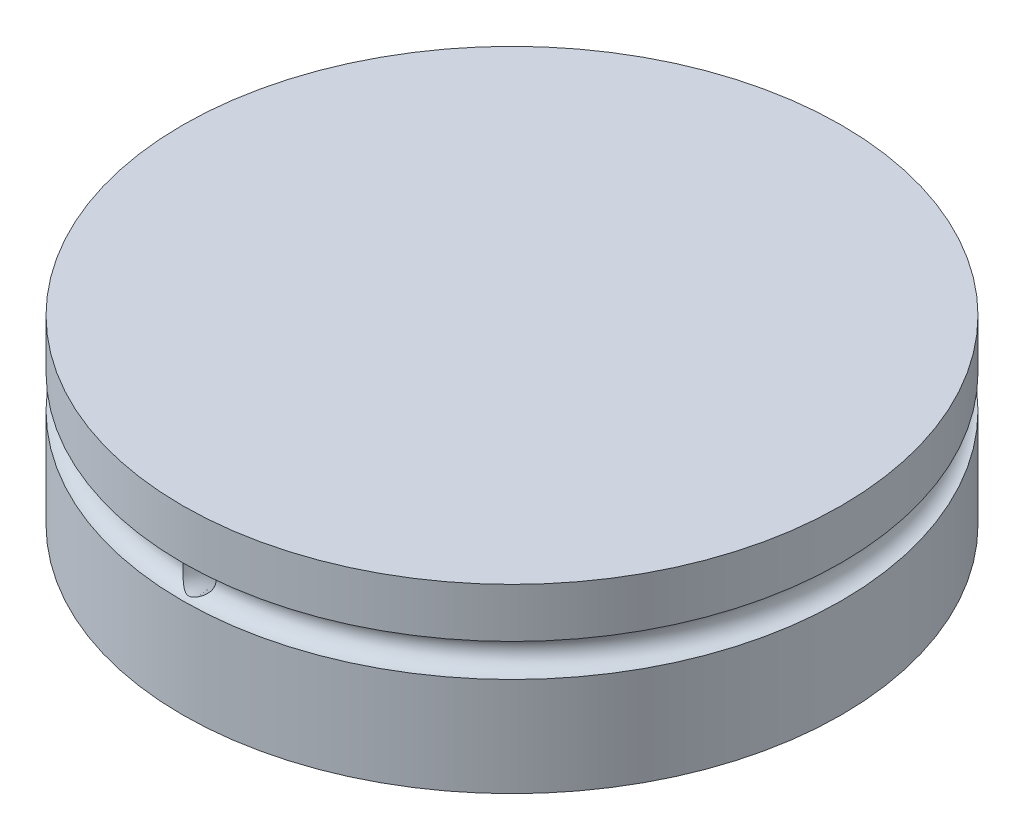
ISO-10303-21;
HEADER;
FILE_DESCRIPTION(('STEP AP214'),'2;1');
FILE_NAME('part.step','',(''),(''),'','','');
FILE_SCHEMA(('AUTOMOTIVE_DESIGN { 1 0 10303 214 1 1 1 1 }'));
ENDSEC;
DATA;
#1=APPLICATION_CONTEXT('core data for automotive mechanical design processes');
#2=APPLICATION_PROTOCOL_DEFINITION('international standard','automotive_design',2000,#1);
#3=PRODUCT_CONTEXT('',#1,'mechanical');
#4=PRODUCT('Part','Part','',(#3));
#5=PRODUCT_RELATED_PRODUCT_CATEGORY('part','',(#4));
#6=PRODUCT_DEFINITION_FORMATION('','',#4);
#7=PRODUCT_DEFINITION_CONTEXT('part definition',#1,'design');
#8=PRODUCT_DEFINITION('design','',#6,#7);
#9=PRODUCT_DEFINITION_SHAPE('','',#8);
#10=(LENGTH_UNIT() NAMED_UNIT(*) SI_UNIT(.MILLI.,.METRE.));
#11=(NAMED_UNIT(*) PLANE_ANGLE_UNIT() SI_UNIT($,.RADIAN.));
#12=(NAMED_UNIT(*) SI_UNIT($,.STERADIAN.) SOLID_ANGLE_UNIT());
#13=UNCERTAINTY_MEASURE_WITH_UNIT(LENGTH_MEASURE(1.E-05),#10,'distance_accuracy_value','');
#14=(GEOMETRIC_REPRESENTATION_CONTEXT(3) GLOBAL_UNCERTAINTY_ASSIGNED_CONTEXT((#13)) GLOBAL_UNIT_ASSIGNED_CONTEXT((#10,
#11,#12)) REPRESENTATION_CONTEXT('',''));
#15=CARTESIAN_POINT('',(0.,0.,0.));
#16=DIRECTION('',(0.,0.,1.));
#17=DIRECTION('',(1.,0.,0.));
#18=AXIS2_PLACEMENT_3D('',#15,#16,#17);
#19=CARTESIAN_POINT('',(0.,0.,0.));
#20=DIRECTION('',(0.,1.,0.));
#21=DIRECTION('',(0.,0.,1.));
#22=AXIS2_PLACEMENT_3D('',#19,#20,#21);
#23=PLANE('',#22);
#24=CARTESIAN_POINT('',(0.,0.,0.));
#25=DIRECTION('',(0.,1.,0.));
#26=DIRECTION('',(0.,0.,1.));
#27=AXIS2_PLACEMENT_3D('',#24,#25,#26);
#28=CIRCLE('',#27,20.);
#29=CARTESIAN_POINT('',(0.,0.,20.));
#30=VERTEX_POINT('',#29);
#31=EDGE_CURVE('E154',#30,#30,#28,.T.);
#32=ORIENTED_EDGE('',*,*,#31,.F.);
#33=EDGE_LOOP('',(#32));
#34=FACE_BOUND('',#33,.T.);
#35=CARTESIAN_POINT('',(0.,0.,0.));
#36=DIRECTION('',(0.,1.,0.));
#37=DIRECTION('',(1.,0.,0.));
#38=AXIS2_PLACEMENT_3D('',#35,#36,#37);
#39=ELLIPSE('',#38,19.,6.);
#40=CARTESIAN_POINT('',(19.,0.,0.));
#41=VERTEX_POINT('',#40);
#42=EDGE_CURVE('E136',#41,#41,#39,.T.);
#43=ORIENTED_EDGE('',*,*,#42,.T.);
#44=EDGE_LOOP('',(#43));
#45=FACE_BOUND('',#44,.T.);
#46=CARTESIAN_POINT('',(0.,2.87470150810809E-09,11.9189853511078));
#47=CARTESIAN_POINT('',(-0.0561777969338795,3.53265097395155E-09,11.9189891886402));
#48=CARTESIAN_POINT('',(-0.112414155046162,6.48629694471309E-10,11.9237415156804));
#49=CARTESIAN_POINT('',(-0.195516780584959,-3.24851267192243E-10,11.9378797379032));
#50=CARTESIAN_POINT('',(-0.223031183899827,-8.90044293983763E-11,11.943768526186));
#51=CARTESIAN_POINT('',(-0.277493185797707,8.90830293124296E-11,11.9578459703527));
#52=CARTESIAN_POINT('',(-0.304440262377215,3.10641823119621E-11,11.9660366526601));
#53=CARTESIAN_POINT('',(-0.384033110352354,-6.20077604010487E-11,11.9939601855703));
#54=CARTESIAN_POINT('',(-0.435539560435894,-1.66150531424652E-11,12.0170631864975));
#55=CARTESIAN_POINT('',(-0.533916964943558,1.66153755751169E-11,12.0715779168258));
#56=CARTESIAN_POINT('',(-0.580787829391597,4.45198010174337E-12,12.1029898074578));
#57=CARTESIAN_POINT('',(-0.668596507700987,-4.45193758655769E-12,12.1732386694411));
#58=CARTESIAN_POINT('',(-0.709534495554499,-1.19291218578032E-12,12.2120754229675));
#59=CARTESIAN_POINT('',(-0.784308982924737,1.19295902058882E-12,12.2960713578728));
#60=CARTESIAN_POINT('',(-0.818145203567523,3.19642588058658E-13,12.341230787416));
#61=CARTESIAN_POINT('',(-0.877755557618486,-3.19636634941162E-13,12.4365886952946));
#62=CARTESIAN_POINT('',(-0.903529841165609,0.,12.4867870797654));
#63=CARTESIAN_POINT('',(-0.946284800978254,0.,12.5907983321467));
#64=CARTESIAN_POINT('',(-0.963265494925926,0.,12.6446111927888));
#65=CARTESIAN_POINT('',(-0.987951527529939,0.,12.7543240538217));
#66=CARTESIAN_POINT('',(-0.995656848504105,0.,12.8102240581911));
#67=CARTESIAN_POINT('',(-1.00157329044895,0.,12.9225241556603));
#68=CARTESIAN_POINT('',(-0.999784428527204,0.,12.9789242478589));
#69=CARTESIAN_POINT('',(-0.98676333543744,0.,13.0906236153357));
#70=CARTESIAN_POINT('',(-0.975531100745607,0.,13.1459228902033));
#71=CARTESIAN_POINT('',(-0.943942086909743,0.,13.253850875258));
#72=CARTESIAN_POINT('',(-0.923585298133772,0.,13.306479582626));
#73=CARTESIAN_POINT('',(-0.874325052556035,0.,13.40757237774));
#74=CARTESIAN_POINT('',(-0.845421598535563,0.,13.4560364668413));
#75=CARTESIAN_POINT('',(-0.77988851749711,0.,13.5474242725355));
#76=CARTESIAN_POINT('',(-0.743258893606428,0.,13.5903479913709));
#77=CARTESIAN_POINT('',(-0.66331326724979,0.,13.6694366073531));
#78=CARTESIAN_POINT('',(-0.619997263867522,0.,13.7056015035736));
#79=CARTESIAN_POINT('',(-0.527908489953462,0.,13.7701458562925));
#80=CARTESIAN_POINT('',(-0.479135718708562,0.,13.7985253117735));
#81=CARTESIAN_POINT('',(-0.377517931624595,0.,13.8466931663077));
#82=CARTESIAN_POINT('',(-0.324672915959887,0.,13.8664815657287));
#83=CARTESIAN_POINT('',(-0.216410755334807,0.,13.8969055747304));
#84=CARTESIAN_POINT('',(-0.160993610490312,0.,13.9075411847233));
#85=CARTESIAN_POINT('',(-0.0491603190299546,0.,13.9193577026984));
#86=CARTESIAN_POINT('',(0.00725582758590798,0.,13.9205386106805));
#87=CARTESIAN_POINT('',(0.119485636664509,0.,13.913412201967));
#88=CARTESIAN_POINT('',(0.175299299100105,0.,13.905104884844));
#89=CARTESIAN_POINT('',(0.28473975373675,0.,13.8792378449822));
#90=CARTESIAN_POINT('',(0.338366545844167,0.,13.8616781218474));
#91=CARTESIAN_POINT('',(0.441910943338351,0.,13.8178047415757));
#92=CARTESIAN_POINT('',(0.491828549209845,0.,13.7914910855828));
#93=CARTESIAN_POINT('',(0.586537561610919,0.,13.7308568104446));
#94=CARTESIAN_POINT('',(0.631328968843,0.,13.6965361923964));
#95=CARTESIAN_POINT('',(0.714514112869744,0.,13.6208622368157));
#96=CARTESIAN_POINT('',(0.752907847074838,0.,13.5795088964365));
#97=CARTESIAN_POINT('',(0.822207748826863,0.,13.4909433916648));
#98=CARTESIAN_POINT('',(0.853113913937177,0.,13.4437312253657));
#99=CARTESIAN_POINT('',(0.906561296057692,0.,13.3447883474134));
#100=CARTESIAN_POINT('',(0.929102521897967,0.,13.2930576405301));
#101=CARTESIAN_POINT('',(0.965180189593747,0.,13.1865461413686));
#102=CARTESIAN_POINT('',(0.978716634809352,0.,13.1317653502287));
#103=CARTESIAN_POINT('',(0.996400499385577,0.,13.0207086209836));
#104=CARTESIAN_POINT('',(1.00054790182804,0.,12.9644326801846));
#105=CARTESIAN_POINT('',(0.999335944240418,0.,12.8519833883211));
#106=CARTESIAN_POINT('',(0.993976602333572,0.,12.7958100370613));
#107=CARTESIAN_POINT('',(0.97390313942512,0.,12.6851602142085));
#108=CARTESIAN_POINT('',(0.959188999612837,0.,12.6306837460279));
#109=CARTESIAN_POINT('',(0.920823881849715,0.,12.5249735637176));
#110=CARTESIAN_POINT('',(0.897172737458581,1.15395163775835E-13,12.473739910002));
#111=CARTESIAN_POINT('',(0.841603801048067,-1.15390633435478E-13,12.3759716413853));
#112=CARTESIAN_POINT('',(0.809686333608442,-4.30534653105358E-13,12.3294368420819));
#113=CARTESIAN_POINT('',(0.738498023506441,4.30547282226482E-13,12.2423880563282));
#114=CARTESIAN_POINT('',(0.699226965170736,1.60681698471441E-12,12.2018742465298));
#115=CARTESIAN_POINT('',(0.614415026423446,-1.60678580333915E-12,12.1280033822709));
#116=CARTESIAN_POINT('',(0.568874267696807,-5.99655027955269E-12,12.0946461889439));
#117=CARTESIAN_POINT('',(0.496874769950151,3.00380430567197E-12,12.050705120873));
#118=CARTESIAN_POINT('',(0.472234522890473,8.61444866565671E-12,12.0370636239728));
#119=CARTESIAN_POINT('',(0.421917221888297,-8.60684794832647E-12,12.0119149996596));
#120=CARTESIAN_POINT('',(0.396241101925528,-3.14136977721695E-11,12.0004059996652));
#121=CARTESIAN_POINT('',(0.317928331225468,6.27236500084758E-11,11.9692123201076));
#122=CARTESIAN_POINT('',(0.263926994706586,3.416138159243E-10,11.9528120688839));
#123=CARTESIAN_POINT('',(0.174660736143102,-2.13474417787134E-10,11.9337286228928));
#124=CARTESIAN_POINT('',(0.139965770384949,-6.69255801754933E-10,11.9282076759696));
#125=CARTESIAN_POINT('',(0.0701881591350702,6.69255801754937E-10,11.9208348410399));
#126=CARTESIAN_POINT('',(0.0351055136433434,2.46354878923262E-09,11.9189829530332));
#127=CARTESIAN_POINT('',(0.,2.87470150810809E-09,11.9189853511078));
#128=B_SPLINE_CURVE_WITH_KNOTS('',3,(#46,#47,#48,#49,#50,#51,#52,#53,#54,#55,#56,#57,#58,#59,
#60,#61,#62,#63,#64,#65,#66,#67,#68,#69,#70,#71,#72,#73,#74,#75,#76,#77,#78,#79,#80,#81,#82,#83,
#84,#85,#86,#87,#88,#89,#90,#91,#92,#93,#94,#95,#96,#97,#98,#99,#100,#101,#102,#103,#104,#105,
#106,#107,#108,#109,#110,#111,#112,#113,#114,#115,#116,#117,#118,#119,#120,#121,#122,#123,#124,
#125,#126,#127),.UNSPECIFIED.,.T.,.F.,(4,2,2,2,2,2,2,2,2,2,2,2,2,2,2,2,2,2,2,2,2,2,2,2,2,2,2,2,
2,2,2,2,2,2,2,2,2,2,2,2,4),(0.,0.168383207624001,0.252714065179229,0.337119395411836,
0.505602358880006,0.674088591938001,0.842569882837178,1.01105778846382,1.17954255612219,
1.3480269849901,1.51651173504905,1.68499618151538,1.85348069085211,2.02196537804266,
2.19045001040425,2.35893457456894,2.52741916182303,2.69590377109522,2.86438837315346,
3.03287296762132,3.20135756208936,3.36984216414778,3.53832677341998,3.70681136067406,
3.87529592483876,4.04378055720034,4.21226524439039,4.38074975372663,4.54923420019346,
4.71771895025291,4.88620337912082,5.05468814677918,5.22317605240583,5.391657343305,
5.560143576363,5.72862653983117,5.81303187006376,5.89736272761898,6.06574593524295,
6.17096862668298,6.27619131812301),.UNSPECIFIED.);
#129=CARTESIAN_POINT('',(0.,2.87470150810809E-09,11.9189853511078));
#130=VERTEX_POINT('',#129);
#131=EDGE_CURVE('E80',#130,#130,#128,.T.);
#132=ORIENTED_EDGE('',*,*,#131,.T.);
#133=EDGE_LOOP('',(#132));
#134=FACE_BOUND('',#133,.T.);
#135=ADVANCED_FACE('F39',(#34,#45,#134),#23,.F.);
#136=CARTESIAN_POINT('',(0.,7.,0.));
#137=DIRECTION('',(0.,1.,0.));
#138=DIRECTION('',(0.,0.,1.));
#139=AXIS2_PLACEMENT_3D('',#136,#137,#138);
#140=TOROIDAL_SURFACE('',#139,20.,1.);
#141=CARTESIAN_POINT('',(-20.,7.,0.));
#142=DIRECTION('',(0.,0.,1.));
#143=DIRECTION('',(1.,0.,0.));
#144=AXIS2_PLACEMENT_3D('',#141,#142,#143);
#145=CIRCLE('',#144,1.);
#146=CARTESIAN_POINT('',(-20.,6.,0.));
#147=VERTEX_POINT('',#146);
#148=CARTESIAN_POINT('',(-20.,8.,0.));
#149=VERTEX_POINT('',#148);
#150=EDGE_CURVE('E67',#147,#149,#145,.T.);
#151=ORIENTED_EDGE('',*,*,#150,.F.);
#152=CARTESIAN_POINT('',(0.,6.,0.));
#153=DIRECTION('',(0.,1.,0.));
#154=DIRECTION('',(0.,0.,1.));
#155=AXIS2_PLACEMENT_3D('',#152,#153,#154);
#156=CIRCLE('',#155,20.);
#157=EDGE_CURVE('E157',#147,#147,#156,.F.);
#158=ORIENTED_EDGE('',*,*,#157,.F.);
#159=ORIENTED_EDGE('',*,*,#150,.T.);
#160=CARTESIAN_POINT('',(0.,8.,0.));
#161=DIRECTION('',(0.,-1.,0.));
#162=DIRECTION('',(0.,0.,-1.));
#163=AXIS2_PLACEMENT_3D('',#160,#161,#162);
#164=CIRCLE('',#163,20.);
#165=EDGE_CURVE('E76',#149,#149,#164,.F.);
#166=ORIENTED_EDGE('',*,*,#165,.F.);
#167=EDGE_LOOP('',(#151,#158,#159,#166));
#168=FACE_BOUND('',#167,.T.);
#169=CARTESIAN_POINT('',(1.0002,7.94564484108663,19.6493589445245));
#170=CARTESIAN_POINT('',(0.83351066611127,7.94274363794833,19.6494869745272));
#171=CARTESIAN_POINT('',(0.666808273116585,7.94049694264779,19.6495861211198));
#172=CARTESIAN_POINT('',(0.333403919376791,7.93745434115968,19.6497203910272));
#173=CARTESIAN_POINT('',(0.166701959688395,7.93665831758253,19.6497555195225));
#174=CARTESIAN_POINT('',(-0.166701959688395,7.93665831758253,19.6497555195225));
#175=CARTESIAN_POINT('',(-0.33340391937679,7.93745434115968,19.6497203910272));
#176=CARTESIAN_POINT('',(-0.666808273116585,7.94049694264779,19.6495861211198));
#177=CARTESIAN_POINT('',(-0.833510666111269,7.94274363794833,19.6494869745272));
#178=CARTESIAN_POINT('',(-1.0002,7.94564484108663,19.6493589445245));
#179=B_SPLINE_CURVE_WITH_KNOTS('',3,(#169,#170,#171,#172,#173,#174,#175,#176,#177,#178),
.UNSPECIFIED.,.F.,.F.,(4,2,2,2,4),(0.,0.500145203872669,1.00024993377201,1.50035466367135,
2.00049986754402),.UNSPECIFIED.);
#180=CARTESIAN_POINT('',(0.500577106075189,7.93897996426433,19.6496530653278));
#181=VERTEX_POINT('',#180);
#182=CARTESIAN_POINT('',(-0.500577106075189,7.93897996426433,19.6496530653278));
#183=VERTEX_POINT('',#182);
#184=EDGE_CURVE('E11',#181,#183,#179,.T.);
#185=ORIENTED_EDGE('',*,*,#184,.F.);
#186=CARTESIAN_POINT('',(-0.500577106075189,7.93897996426433,19.6496530653278));
#187=CARTESIAN_POINT('',(-0.510312573452956,7.93256338352839,19.6318913777983));
#188=CARTESIAN_POINT('',(-0.520319387296241,7.9257177454184,19.6144434172663));
#189=CARTESIAN_POINT('',(-0.540714713225233,7.91118794679573,19.580136635165));
#190=CARTESIAN_POINT('',(-0.551103107340248,7.90350404402043,19.5632776346039));
#191=CARTESIAN_POINT('',(-0.58261756022306,7.87921109196602,19.5134964423416));
#192=CARTESIAN_POINT('',(-0.604084307143522,7.86136630749009,19.481385152021));
#193=CARTESIAN_POINT('',(-0.647272353337239,7.82225696355579,19.4189502062253));
#194=CARTESIAN_POINT('',(-0.668994168517771,7.8009622557838,19.3886458664641));
#195=CARTESIAN_POINT('',(-0.711869068458888,7.75506768772226,19.330247065621));
#196=CARTESIAN_POINT('',(-0.733022420160236,7.73046941246887,19.3021515549393));
#197=CARTESIAN_POINT('',(-0.782711440469058,7.6671122551653,19.2373212809327));
#198=CARTESIAN_POINT('',(-0.810712640752544,7.62668571879928,19.2017749957436));
#199=CARTESIAN_POINT('',(-0.862895232202879,7.53925771738382,19.1367280914607));
#200=CARTESIAN_POINT('',(-0.887091088479015,7.49228249749034,19.1072044449356));
#201=CARTESIAN_POINT('',(-0.924943320224795,7.40369805929374,19.0616836278143));
#202=CARTESIAN_POINT('',(-0.939742244389686,7.36337923448976,19.0441374732399));
#203=CARTESIAN_POINT('',(-0.965082385664703,7.27951285054936,19.0143684009481));
#204=CARTESIAN_POINT('',(-0.975624459425583,7.23596594312376,19.0021444121565));
#205=CARTESIAN_POINT('',(-0.991484459938566,7.14622885468305,18.9838139795863));
#206=CARTESIAN_POINT('',(-0.996756058516016,7.10001894531056,18.9777617775273));
#207=CARTESIAN_POINT('',(-1.00103979385768,7.00693107484778,18.9725518323745));
#208=CARTESIAN_POINT('',(-1.00005841360649,6.96005385592539,18.9733869488876));
#209=CARTESIAN_POINT('',(-0.992133329313797,6.8740175862027,18.9812500790577));
#210=CARTESIAN_POINT('',(-0.986040579867097,6.83469419008695,18.987397816042));
#211=CARTESIAN_POINT('',(-0.969203269031962,6.75807376137553,19.0042203624142));
#212=CARTESIAN_POINT('',(-0.958458115962878,6.72077698719966,19.0148957476131));
#213=CARTESIAN_POINT('',(-0.932784429745808,6.64899318330435,19.0400309778075));
#214=CARTESIAN_POINT('',(-0.917851312544471,6.61450928619126,19.0544949685755));
#215=CARTESIAN_POINT('',(-0.884388010388671,6.54877363505876,19.0863849771744));
#216=CARTESIAN_POINT('',(-0.86585280205823,6.51752648931184,19.1038151272581));
#217=CARTESIAN_POINT('',(-0.830307333549392,6.46511055814014,19.1366601023712));
#218=CARTESIAN_POINT('',(-0.813893512434227,6.4432567346225,19.1516449416331));
#219=CARTESIAN_POINT('',(-0.77951565326124,6.40159184722957,19.1825790957237));
#220=CARTESIAN_POINT('',(-0.761552825648,6.3817792144024,19.1985276546052));
#221=CARTESIAN_POINT('',(-0.705507198480556,6.32518556378688,19.2475004188085));
#222=CARTESIAN_POINT('',(-0.665342746044015,6.29135687417353,19.2815809412728));
#223=CARTESIAN_POINT('',(-0.579230634315518,6.23007608045783,19.3515881019396));
#224=CARTESIAN_POINT('',(-0.5331431636948,6.20285193048978,19.3875392862696));
#225=CARTESIAN_POINT('',(-0.460580745016207,6.16744647242633,19.4402297048811));
#226=CARTESIAN_POINT('',(-0.435835085540525,6.15655401243388,19.4575784654803));
#227=CARTESIAN_POINT('',(-0.385077320014485,6.1365488293898,19.4914173628048));
#228=CARTESIAN_POINT('',(-0.359065952186038,6.12743508408845,19.5079079886903));
#229=CARTESIAN_POINT('',(-0.305842206252553,6.11109041698526,19.539220832782));
#230=CARTESIAN_POINT('',(-0.278643954098658,6.10384206056937,19.5540577056529));
#231=CARTESIAN_POINT('',(-0.222562291299749,6.09123522127696,19.5811913131714));
#232=CARTESIAN_POINT('',(-0.193680261170535,6.08587521486465,19.5934900922392));
#233=CARTESIAN_POINT('',(-0.139442009670261,6.07806976783558,19.6120596899294));
#234=CARTESIAN_POINT('',(-0.114380339325212,6.07527432168525,19.6190155106655));
#235=CARTESIAN_POINT('',(-0.06338505552362,6.07134071561369,19.6289409325741));
#236=CARTESIAN_POINT('',(-0.0374544674598696,6.07019731509441,19.6319231364509));
#237=CARTESIAN_POINT('',(0.0146852161173916,6.06968153837629,19.6332578197133));
#238=CARTESIAN_POINT('',(0.0408950573661114,6.0703181995601,19.6315866741949));
#239=CARTESIAN_POINT('',(0.0926086300525259,6.07330736285515,19.6239592366755));
#240=CARTESIAN_POINT('',(0.118110205135169,6.07566461160378,19.6179910910296));
#241=CARTESIAN_POINT('',(0.181026423668259,6.08353486585212,19.5989062251576));
#242=CARTESIAN_POINT('',(0.217646755741166,6.09005582745973,19.5836803116449));
#243=CARTESIAN_POINT('',(0.288315329169719,6.10609609404746,19.5492595506134));
#244=CARTESIAN_POINT('',(0.322350820876687,6.11562919790787,19.5300465799225));
#245=CARTESIAN_POINT('',(0.386685117589146,6.13697087140598,19.4905812967374));
#246=CARTESIAN_POINT('',(0.417084542359565,6.14865034912405,19.4704212506669));
#247=CARTESIAN_POINT('',(0.476182429128903,6.17454704322838,19.4292170057823));
#248=CARTESIAN_POINT('',(0.50487952346851,6.18876626423471,19.4081721186689));
#249=CARTESIAN_POINT('',(0.560599661232849,6.21979277300961,19.3658633331163));
#250=CARTESIAN_POINT('',(0.587624923330277,6.23659652286762,19.344599770599));
#251=CARTESIAN_POINT('',(0.639980501869987,6.27292564091744,19.3023128466571));
#252=CARTESIAN_POINT('',(0.665310774424849,6.29245107954009,19.2812894914636));
#253=CARTESIAN_POINT('',(0.725462650255884,6.34412251065926,19.2303072454341));
#254=CARTESIAN_POINT('',(0.759227333753498,6.37791778874175,19.2007340871253));
#255=CARTESIAN_POINT('',(0.821744214375741,6.45202488538126,19.1446629729801));
#256=CARTESIAN_POINT('',(0.850506511946177,6.49232324840903,19.1181588574147));
#257=CARTESIAN_POINT('',(0.896107185931603,6.5700164264948,19.0753166113238));
#258=CARTESIAN_POINT('',(0.914178924194399,6.60615061537708,19.0580198858557));
#259=CARTESIAN_POINT('',(0.945609442113411,6.68205245918308,19.0275494475845));
#260=CARTESIAN_POINT('',(0.958971249024728,6.72181775947865,19.0143730870804));
#261=CARTESIAN_POINT('',(0.98035715698996,6.80440101716456,18.9931093756117));
#262=CARTESIAN_POINT('',(0.988343771732982,6.84723815372407,18.985057785215));
#263=CARTESIAN_POINT('',(0.998453946389313,6.93428970592164,18.9749523708839));
#264=CARTESIAN_POINT('',(1.00057965222058,6.97850361147038,18.9728963517102));
#265=CARTESIAN_POINT('',(0.99922459398917,7.06184818307611,18.9748480410081));
#266=CARTESIAN_POINT('',(0.996329683697504,7.10100761322661,18.9782192262932));
#267=CARTESIAN_POINT('',(0.986471166240645,7.17810473896513,18.9896136352454));
#268=CARTESIAN_POINT('',(0.979506794338709,7.21604220350609,18.9976377332897));
#269=CARTESIAN_POINT('',(0.961641706994491,7.29190024843576,19.0184111047685));
#270=CARTESIAN_POINT('',(0.950550889301333,7.32971205079136,19.0313895315877));
#271=CARTESIAN_POINT('',(0.92524549319927,7.40262307184979,19.0613557579498));
#272=CARTESIAN_POINT('',(0.911026575544429,7.43771843001565,19.0783491294));
#273=CARTESIAN_POINT('',(0.871995851034133,7.52261106593454,19.1255951367364));
#274=CARTESIAN_POINT('',(0.845551687033869,7.5704037312469,19.1581146991598));
#275=CARTESIAN_POINT('',(0.788980988444055,7.65869593281209,19.2293459462821));
#276=CARTESIAN_POINT('',(0.758844696005742,7.699175411658,19.2680741266263));
#277=CARTESIAN_POINT('',(0.695926180464116,7.77367839274623,19.3515006840893));
#278=CARTESIAN_POINT('',(0.663099544988109,7.80753527103123,19.3963142290462));
#279=CARTESIAN_POINT('',(0.613938781542067,7.85259779018045,19.4670422479316));
#280=CARTESIAN_POINT('',(0.59758034649195,7.86665433245489,19.4911786230203));
#281=CARTESIAN_POINT('',(0.565218142777177,7.89287297759385,19.5406821338143));
#282=CARTESIAN_POINT('',(0.549214177334938,7.90503615534507,19.5660485603966));
#283=CARTESIAN_POINT('',(0.527989078165047,7.92027705289123,19.6014935616146));
#284=CARTESIAN_POINT('',(0.522403921914937,7.92419960791969,19.6109985741662));
#285=CARTESIAN_POINT('',(0.511376314770293,7.93178501173895,19.6301880044262));
#286=CARTESIAN_POINT('',(0.505933813192976,7.93544795357619,19.639872356273));
#287=CARTESIAN_POINT('',(0.50057710607532,7.93897996426419,19.6496530653279));
#288=B_SPLINE_CURVE_WITH_KNOTS('',3,(#186,#187,#188,#189,#190,#191,#192,#193,#194,#195,#196,
#197,#198,#199,#200,#201,#202,#203,#204,#205,#206,#207,#208,#209,#210,#211,#212,#213,#214,#215,
#216,#217,#218,#219,#220,#221,#222,#223,#224,#225,#226,#227,#228,#229,#230,#231,#232,#233,#234,
#235,#236,#237,#238,#239,#240,#241,#242,#243,#244,#245,#246,#247,#248,#249,#250,#251,#252,#253,
#254,#255,#256,#257,#258,#259,#260,#261,#262,#263,#264,#265,#266,#267,#268,#269,#270,#271,#272,
#273,#274,#275,#276,#277,#278,#279,#280,#281,#282,#283,#284,#285,#286,#287),.UNSPECIFIED.,.F.,
.F.,(4,2,2,2,2,2,2,2,2,2,2,2,2,2,2,2,2,2,2,2,2,2,2,2,2,2,2,2,2,2,2,2,2,2,2,2,2,2,2,2,2,2,2,2,2,
2,2,2,2,2,4),(0.,0.0637186432972677,0.127417750239279,0.254870372009991,0.383503673109705,
0.512075475587363,0.693430546050085,0.874078646363871,1.01274048738771,1.15137441010827,
1.29121650311306,1.43091363376709,1.55112049408955,1.6713426465018,1.79169690851216,
1.91222023353104,2.00560446928606,2.09891638157452,2.28598349125534,2.47880041467095,
2.57510931840436,2.67136270814747,2.76668081844523,2.86192184826218,2.94011107693664,
3.01805172602743,3.09638879770583,3.17494280099361,3.29484206422884,3.41529876039425,
3.53005277263867,3.64489776376794,3.75958692248724,3.87427904964081,4.04224874896606,
4.2098752563944,4.34120636864082,4.4724529147194,4.60460553695195,4.73670976628627,
4.85441453024724,4.97214142050603,5.09614610863333,5.2203239109113,5.4099741866276,
5.60013695885194,5.79459841007258,5.89164747201579,5.98864123546047,6.02374184975914,
6.05882981956224),.UNSPECIFIED.);
#289=EDGE_CURVE('E54',#183,#181,#288,.T.);
#290=ORIENTED_EDGE('',*,*,#289,.F.);
#291=EDGE_LOOP('',(#185,#290));
#292=FACE_BOUND('',#291,.T.);
#293=ADVANCED_FACE('F82',(#168,#292),#140,.F.);
#294=CARTESIAN_POINT('',(0.,3.,0.));
#295=DIRECTION('',(0.,-1.,0.));
#296=DIRECTION('',(0.,0.,-1.));
#297=AXIS2_PLACEMENT_3D('',#294,#295,#296);
#298=CYLINDRICAL_SURFACE('',#297,20.);
#299=ORIENTED_EDGE('',*,*,#157,.T.);
#300=EDGE_LOOP('',(#299));
#301=FACE_BOUND('',#300,.T.);
#302=ORIENTED_EDGE('',*,*,#31,.T.);
#303=EDGE_LOOP('',(#302));
#304=FACE_BOUND('',#303,.T.);
#305=ADVANCED_FACE('F41',(#301,#304),#298,.T.);
#306=CARTESIAN_POINT('',(0.,3.,0.));
#307=DIRECTION('',(0.,1.,0.));
#308=DIRECTION('',(1.,0.,0.));
#309=AXIS2_PLACEMENT_3D('',#306,#307,#308);
#310=ELLIPSE('',#309,19.,6.);
#311=DIRECTION('',(0.,-1.,0.));
#312=VECTOR('',#311,1.);
#313=SURFACE_OF_LINEAR_EXTRUSION('',#310,#312);
#314=CARTESIAN_POINT('',(19.,3.,0.));
#315=VERTEX_POINT('',#314);
#316=EDGE_CURVE('E131',#315,#315,#310,.T.);
#317=ORIENTED_EDGE('',*,*,#316,.T.);
#318=EDGE_LOOP('',(#317));
#319=FACE_BOUND('',#318,.T.);
#320=ORIENTED_EDGE('',*,*,#42,.F.);
#321=EDGE_LOOP('',(#320));
#322=FACE_BOUND('',#321,.T.);
#323=ADVANCED_FACE('F88',(#319,#322),#313,.T.);
#324=CARTESIAN_POINT('',(0.,3.,0.));
#325=DIRECTION('',(0.,1.,0.));
#326=DIRECTION('',(0.,0.,1.));
#327=AXIS2_PLACEMENT_3D('',#324,#325,#326);
#328=PLANE('',#327);
#329=ORIENTED_EDGE('',*,*,#316,.F.);
#330=EDGE_LOOP('',(#329));
#331=FACE_BOUND('',#330,.T.);
#332=ADVANCED_FACE('F140',(#331),#328,.F.);
#333=CARTESIAN_POINT('',(0.,11.,0.));
#334=DIRECTION('',(0.,1.,0.));
#335=DIRECTION('',(0.,0.,1.));
#336=AXIS2_PLACEMENT_3D('',#333,#334,#335);
#337=PLANE('',#336);
#338=CARTESIAN_POINT('',(0.,11.,0.));
#339=DIRECTION('',(0.,1.,0.));
#340=DIRECTION('',(0.,0.,1.));
#341=AXIS2_PLACEMENT_3D('',#338,#339,#340);
#342=CIRCLE('',#341,20.);
#343=CARTESIAN_POINT('',(0.,11.,20.));
#344=VERTEX_POINT('',#343);
#345=EDGE_CURVE('E127',#344,#344,#342,.T.);
#346=ORIENTED_EDGE('',*,*,#345,.T.);
#347=EDGE_LOOP('',(#346));
#348=FACE_BOUND('',#347,.T.);
#349=ADVANCED_FACE('F96',(#348),#337,.T.);
#350=ORIENTED_EDGE('',*,*,#165,.T.);
#351=EDGE_LOOP('',(#350));
#352=FACE_BOUND('',#351,.T.);
#353=ORIENTED_EDGE('',*,*,#345,.F.);
#354=EDGE_LOOP('',(#353));
#355=FACE_BOUND('',#354,.T.);
#356=ADVANCED_FACE('F90',(#352,#355),#298,.T.);
#357=CARTESIAN_POINT('',(0.,7.07412972777976,19.6878188789045));
#358=DIRECTION('',(0.,-0.0440870604817835,-0.999027692858449));
#359=DIRECTION('',(0.,0.999027692858449,-0.0440870604817835));
#360=AXIS2_PLACEMENT_3D('',#357,#358,#359);
#361=PLANE('',#360);
#362=ORIENTED_EDGE('',*,*,#184,.T.);
#363=CARTESIAN_POINT('',(0.,7.07412972777976,19.6878188789045));
#364=DIRECTION('',(0.,-0.0440870604817835,-0.999027692858449));
#365=DIRECTION('',(0.,0.999027692858449,-0.0440870604817835));
#366=AXIS2_PLACEMENT_3D('',#363,#364,#365);
#367=CIRCLE('',#366,1.);
#368=EDGE_CURVE('E60',#183,#181,#367,.T.);
#369=ORIENTED_EDGE('',*,*,#368,.T.);
#370=EDGE_LOOP('',(#362,#369));
#371=FACE_BOUND('',#370,.T.);
#372=ADVANCED_FACE('F78',(#371),#361,.T.);
#373=CARTESIAN_POINT('',(0.,-1.10467191777719,11.9628141575531));
#374=CARTESIAN_POINT('',(0.,-0.766303306348451,11.9450809944638));
#375=CARTESIAN_POINT('',(0.,-0.38789177625252,11.918984763601));
#376=CARTESIAN_POINT('',(0.,0.9952640456968,11.91898685855));
#377=CARTESIAN_POINT('',(0.,2.02898644281529,12.1064829780825));
#378=CARTESIAN_POINT('',(0.,3.99449345249703,12.8958878435037));
#379=CARTESIAN_POINT('',(0.,4.90473619856009,13.4897184671915));
#380=CARTESIAN_POINT('',(0.,6.4257793593401,14.9850653433124));
#381=CARTESIAN_POINT('',(0.,7.01954174426691,15.8686746950979));
#382=CARTESIAN_POINT('',(0.,7.82558075337056,17.7412134864299));
#383=CARTESIAN_POINT('',(0.,8.03203151773989,18.7118048948909));
#384=CARTESIAN_POINT('',(0.,8.07315742063821,19.6437318184227));
#385=CARTESIAN_POINT('',(2.,-1.10467191777719,11.9628141575531));
#386=CARTESIAN_POINT('',(2.,-0.766303306348451,11.9450809944638));
#387=CARTESIAN_POINT('',(2.,-0.38789177625252,11.918984763601));
#388=CARTESIAN_POINT('',(2.,0.9952640456968,11.91898685855));
#389=CARTESIAN_POINT('',(2.,2.02898644281529,12.1064829780825));
#390=CARTESIAN_POINT('',(2.,3.99449345249703,12.8958878435037));
#391=CARTESIAN_POINT('',(2.,4.90473619856009,13.4897184671915));
#392=CARTESIAN_POINT('',(2.,6.4257793593401,14.9850653433124));
#393=CARTESIAN_POINT('',(2.,7.01954174426691,15.8686746950979));
#394=CARTESIAN_POINT('',(2.,7.82558075337056,17.7412134864299));
#395=CARTESIAN_POINT('',(2.,8.03203151773989,18.7118048948909));
#396=CARTESIAN_POINT('',(2.,8.07315742063821,19.6437318184227));
#397=CARTESIAN_POINT('',(2.,-1.00000000528983,13.9600732270622));
#398=CARTESIAN_POINT('',(2.,-0.642189466535778,13.9413211527898));
#399=CARTESIAN_POINT('',(2.,-0.29100105164036,13.9189850262204));
#400=CARTESIAN_POINT('',(2.,0.746658995340654,13.9189861847133));
#401=CARTESIAN_POINT('',(2.,1.53269238645124,14.0624350226287));
#402=CARTESIAN_POINT('',(2.,3.00001434310937,14.6517541361441));
#403=CARTESIAN_POINT('',(2.,3.69540777381587,15.1054575689292));
#404=CARTESIAN_POINT('',(2.,4.83087686750018,16.2217443326816));
#405=CARTESIAN_POINT('',(2.,5.28430238109381,16.8959202879164));
#406=CARTESIAN_POINT('',(2.,5.88674621799665,18.2954801408025));
#407=CARTESIAN_POINT('',(2.,6.04437451020727,19.035609766581));
#408=CARTESIAN_POINT('',(2.,6.07510203492131,19.7319059393863));
#409=CARTESIAN_POINT('',(0.,-1.00000000528983,13.9600732270622));
#410=CARTESIAN_POINT('',(0.,-0.642189466535778,13.9413211527898));
#411=CARTESIAN_POINT('',(0.,-0.29100105164036,13.9189850262204));
#412=CARTESIAN_POINT('',(0.,0.746658995340654,13.9189861847133));
#413=CARTESIAN_POINT('',(0.,1.53269238645124,14.0624350226287));
#414=CARTESIAN_POINT('',(0.,3.00001434310937,14.6517541361441));
#415=CARTESIAN_POINT('',(0.,3.69540777381587,15.1054575689292));
#416=CARTESIAN_POINT('',(0.,4.83087686750018,16.2217443326816));
#417=CARTESIAN_POINT('',(0.,5.28430238109381,16.8959202879164));
#418=CARTESIAN_POINT('',(0.,5.88674621799665,18.2954801408025));
#419=CARTESIAN_POINT('',(0.,6.04437451020727,19.035609766581));
#420=CARTESIAN_POINT('',(0.,6.07510203492131,19.7319059393863));
#421=CARTESIAN_POINT('',(-2.,-1.00000000528983,13.9600732270622));
#422=CARTESIAN_POINT('',(-2.,-0.642189466535778,13.9413211527898));
#423=CARTESIAN_POINT('',(-2.,-0.29100105164036,13.9189850262204));
#424=CARTESIAN_POINT('',(-2.,0.746658995340654,13.9189861847133));
#425=CARTESIAN_POINT('',(-2.,1.53269238645124,14.0624350226287));
#426=CARTESIAN_POINT('',(-2.,3.00001434310937,14.6517541361441));
#427=CARTESIAN_POINT('',(-2.,3.69540777381587,15.1054575689292));
#428=CARTESIAN_POINT('',(-2.,4.83087686750018,16.2217443326816));
#429=CARTESIAN_POINT('',(-2.,5.28430238109381,16.8959202879164));
#430=CARTESIAN_POINT('',(-2.,5.88674621799665,18.2954801408025));
#431=CARTESIAN_POINT('',(-2.,6.04437451020727,19.035609766581));
#432=CARTESIAN_POINT('',(-2.,6.07510203492131,19.7319059393863));
#433=CARTESIAN_POINT('',(-2.,-1.10467191777719,11.9628141575531));
#434=CARTESIAN_POINT('',(-2.,-0.766303306348451,11.9450809944638));
#435=CARTESIAN_POINT('',(-2.,-0.38789177625252,11.918984763601));
#436=CARTESIAN_POINT('',(-2.,0.9952640456968,11.91898685855));
#437=CARTESIAN_POINT('',(-2.,2.02898644281529,12.1064829780825));
#438=CARTESIAN_POINT('',(-2.,3.99449345249703,12.8958878435037));
#439=CARTESIAN_POINT('',(-2.,4.90473619856009,13.4897184671915));
#440=CARTESIAN_POINT('',(-2.,6.4257793593401,14.9850653433124));
#441=CARTESIAN_POINT('',(-2.,7.01954174426691,15.8686746950979));
#442=CARTESIAN_POINT('',(-2.,7.82558075337056,17.7412134864299));
#443=CARTESIAN_POINT('',(-2.,8.03203151773989,18.7118048948909));
#444=CARTESIAN_POINT('',(-2.,8.07315742063821,19.6437318184227));
#445=CARTESIAN_POINT('',(0.,-1.10467191777719,11.9628141575531));
#446=CARTESIAN_POINT('',(0.,-0.766303306348451,11.9450809944638));
#447=CARTESIAN_POINT('',(0.,-0.38789177625252,11.918984763601));
#448=CARTESIAN_POINT('',(0.,0.9952640456968,11.91898685855));
#449=CARTESIAN_POINT('',(0.,2.02898644281529,12.1064829780825));
#450=CARTESIAN_POINT('',(0.,3.99449345249703,12.8958878435037));
#451=CARTESIAN_POINT('',(0.,4.90473619856009,13.4897184671915));
#452=CARTESIAN_POINT('',(0.,6.4257793593401,14.9850653433124));
#453=CARTESIAN_POINT('',(0.,7.01954174426691,15.8686746950979));
#454=CARTESIAN_POINT('',(0.,7.82558075337056,17.7412134864299));
#455=CARTESIAN_POINT('',(0.,8.03203151773989,18.7118048948909));
#456=CARTESIAN_POINT('',(0.,8.07315742063821,19.6437318184227));
#457=(BOUNDED_SURFACE() B_SPLINE_SURFACE(3,3,((#373,#374,#375,#376,#377,#378,#379,#380,#381,
#382,#383,#384),(#385,#386,#387,#388,#389,#390,#391,#392,#393,#394,#395,#396),(#397,#398,#399,
#400,#401,#402,#403,#404,#405,#406,#407,#408),(#409,#410,#411,#412,#413,#414,#415,#416,#417,
#418,#419,#420),(#421,#422,#423,#424,#425,#426,#427,#428,#429,#430,#431,#432),(#433,#434,#435,
#436,#437,#438,#439,#440,#441,#442,#443,#444),(#445,#446,#447,#448,#449,#450,#451,#452,#453,
#454,#455,#456)),.UNSPECIFIED.,.T.,.F.,.F.) B_SPLINE_SURFACE_WITH_KNOTS((4,3,4),(4,2,2,2,2,4),
(0.,0.5,1.),(0.,0.0887837941511615,0.316587845613371,0.544391897075581,0.77219594853779,1.),
.UNSPECIFIED.) GEOMETRIC_REPRESENTATION_ITEM() RATIONAL_B_SPLINE_SURFACE(((1.,1.,1.,1.,1.,1.,1.,
1.,1.,1.,1.,1.),(0.333333333333333,0.333333333333333,0.333333333333333,0.333333333333333,
0.333333333333333,0.333333333333333,0.333333333333333,0.333333333333333,0.333333333333333,
0.333333333333333,0.333333333333333,0.333333333333333),(0.333333333333333,0.333333333333333,
0.333333333333333,0.333333333333333,0.333333333333333,0.333333333333333,0.333333333333333,
0.333333333333333,0.333333333333333,0.333333333333333,0.333333333333333,0.333333333333333),(1.,
1.,1.,1.,1.,1.,1.,1.,1.,1.,1.,1.),(0.333333333333333,0.333333333333333,0.333333333333333,
0.333333333333333,0.333333333333333,0.333333333333333,0.333333333333333,0.333333333333333,
0.333333333333333,0.333333333333333,0.333333333333333,0.333333333333333),(0.333333333333333,
0.333333333333333,0.333333333333333,0.333333333333333,0.333333333333333,0.333333333333333,
0.333333333333333,0.333333333333333,0.333333333333333,0.333333333333333,0.333333333333333,
0.333333333333333),(1.,1.,1.,1.,1.,1.,1.,1.,1.,1.,1.,1.))) REPRESENTATION_ITEM('') SURFACE());
#458=ORIENTED_EDGE('',*,*,#131,.F.);
#459=EDGE_LOOP('',(#458));
#460=FACE_BOUND('',#459,.T.);
#461=ORIENTED_EDGE('',*,*,#289,.T.);
#462=ORIENTED_EDGE('',*,*,#368,.F.);
#463=EDGE_LOOP('',(#461,#462));
#464=FACE_BOUND('',#463,.T.);
#465=ADVANCED_FACE('F72',(#460,#464),#457,.T.);
#466=CLOSED_SHELL('',(#135,#293,#305,#323,#332,#349,#356,#372,#465));
#467=MANIFOLD_SOLID_BREP('B2',#466);
#468=ADVANCED_BREP_SHAPE_REPRESENTATION('',(#18,#467),#14);
#469=SHAPE_DEFINITION_REPRESENTATION(#9,#468);
ENDSEC;
END-ISO-10303-21;
